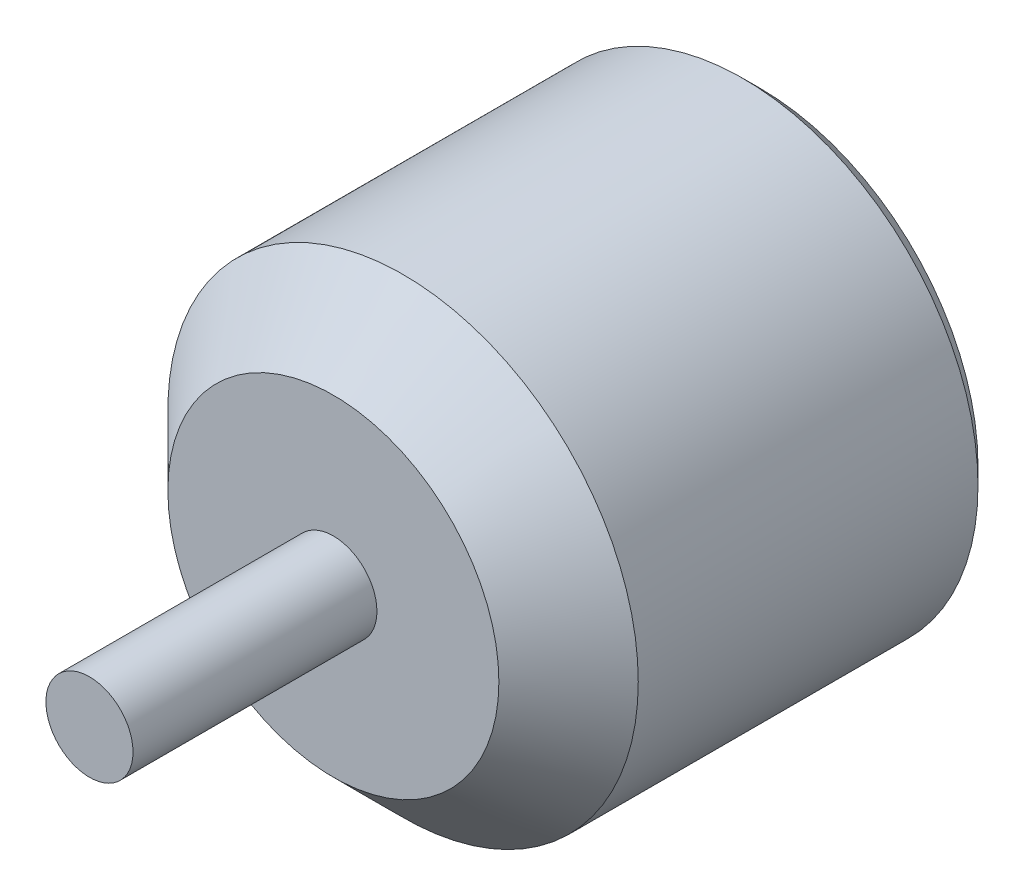
ISO-10303-21;
HEADER;
FILE_DESCRIPTION(('STEP AP214'),'2;1');
FILE_NAME('part.step','',(''),(''),'','','');
FILE_SCHEMA(('AUTOMOTIVE_DESIGN { 1 0 10303 214 1 1 1 1 }'));
ENDSEC;
DATA;
#1=APPLICATION_CONTEXT('core data for automotive mechanical design processes');
#2=APPLICATION_PROTOCOL_DEFINITION('international standard','automotive_design',2000,#1);
#3=PRODUCT_CONTEXT('',#1,'mechanical');
#4=PRODUCT('Part','Part','',(#3));
#5=PRODUCT_RELATED_PRODUCT_CATEGORY('part','',(#4));
#6=PRODUCT_DEFINITION_FORMATION('','',#4);
#7=PRODUCT_DEFINITION_CONTEXT('part definition',#1,'design');
#8=PRODUCT_DEFINITION('design','',#6,#7);
#9=PRODUCT_DEFINITION_SHAPE('','',#8);
#10=(LENGTH_UNIT() NAMED_UNIT(*) SI_UNIT(.MILLI.,.METRE.));
#11=(NAMED_UNIT(*) PLANE_ANGLE_UNIT() SI_UNIT($,.RADIAN.));
#12=(NAMED_UNIT(*) SI_UNIT($,.STERADIAN.) SOLID_ANGLE_UNIT());
#13=UNCERTAINTY_MEASURE_WITH_UNIT(LENGTH_MEASURE(1.E-05),#10,'distance_accuracy_value','');
#14=(GEOMETRIC_REPRESENTATION_CONTEXT(3) GLOBAL_UNCERTAINTY_ASSIGNED_CONTEXT((#13)) GLOBAL_UNIT_ASSIGNED_CONTEXT((#10,
#11,#12)) REPRESENTATION_CONTEXT('',''));
#15=CARTESIAN_POINT('',(0.,0.,0.));
#16=DIRECTION('',(0.,0.,1.));
#17=DIRECTION('',(1.,0.,0.));
#18=AXIS2_PLACEMENT_3D('',#15,#16,#17);
#19=CARTESIAN_POINT('',(0.,0.,24.5));
#20=DIRECTION('',(0.,0.,-1.));
#21=DIRECTION('',(-1.,0.,0.));
#22=AXIS2_PLACEMENT_3D('',#19,#20,#21);
#23=CYLINDRICAL_SURFACE('',#22,13.5);
#24=CARTESIAN_POINT('',(0.,0.,20.5));
#25=DIRECTION('',(0.,0.,1.));
#26=DIRECTION('',(1.,0.,0.));
#27=AXIS2_PLACEMENT_3D('',#24,#25,#26);
#28=CIRCLE('',#27,13.5);
#29=CARTESIAN_POINT('',(13.5,0.,20.5));
#30=VERTEX_POINT('',#29);
#31=EDGE_CURVE('E9',#30,#30,#28,.F.);
#32=ORIENTED_EDGE('',*,*,#31,.T.);
#33=EDGE_LOOP('',(#32));
#34=FACE_BOUND('',#33,.T.);
#35=CARTESIAN_POINT('',(0.,0.,1.));
#36=DIRECTION('',(0.,0.,1.));
#37=DIRECTION('',(1.,0.,0.));
#38=AXIS2_PLACEMENT_3D('',#35,#36,#37);
#39=CIRCLE('',#38,13.5);
#40=CARTESIAN_POINT('',(13.5,0.,1.));
#41=VERTEX_POINT('',#40);
#42=EDGE_CURVE('E37',#41,#41,#39,.T.);
#43=ORIENTED_EDGE('',*,*,#42,.T.);
#44=EDGE_LOOP('',(#43));
#45=FACE_BOUND('',#44,.T.);
#46=ADVANCED_FACE('F14',(#34,#45),#23,.T.);
#47=CARTESIAN_POINT('',(0.,0.,24.5));
#48=DIRECTION('',(0.,0.,1.));
#49=DIRECTION('',(1.,0.,0.));
#50=AXIS2_PLACEMENT_3D('',#47,#48,#49);
#51=PLANE('',#50);
#52=CARTESIAN_POINT('',(0.,0.,24.5));
#53=DIRECTION('',(0.,0.,1.));
#54=DIRECTION('',(1.,0.,0.));
#55=AXIS2_PLACEMENT_3D('',#52,#53,#54);
#56=CIRCLE('',#55,9.5);
#57=CARTESIAN_POINT('',(9.5,0.,24.5));
#58=VERTEX_POINT('',#57);
#59=EDGE_CURVE('E22',#58,#58,#56,.T.);
#60=ORIENTED_EDGE('',*,*,#59,.T.);
#61=EDGE_LOOP('',(#60));
#62=FACE_BOUND('',#61,.T.);
#63=CARTESIAN_POINT('',(0.,0.,24.5));
#64=DIRECTION('',(0.,0.,1.));
#65=DIRECTION('',(1.,0.,0.));
#66=AXIS2_PLACEMENT_3D('',#63,#64,#65);
#67=CIRCLE('',#66,2.5);
#68=CARTESIAN_POINT('',(2.5,0.,24.5));
#69=VERTEX_POINT('',#68);
#70=EDGE_CURVE('E43',#69,#69,#67,.T.);
#71=ORIENTED_EDGE('',*,*,#70,.F.);
#72=EDGE_LOOP('',(#71));
#73=FACE_BOUND('',#72,.T.);
#74=ADVANCED_FACE('F98',(#62,#73),#51,.T.);
#75=CARTESIAN_POINT('',(0.,0.,0.));
#76=DIRECTION('',(0.,0.,1.));
#77=DIRECTION('',(1.,0.,0.));
#78=AXIS2_PLACEMENT_3D('',#75,#76,#77);
#79=PLANE('',#78);
#80=CARTESIAN_POINT('',(0.,0.,0.));
#81=DIRECTION('',(0.,0.,1.));
#82=DIRECTION('',(1.,0.,0.));
#83=AXIS2_PLACEMENT_3D('',#80,#81,#82);
#84=CIRCLE('',#83,12.5);
#85=CARTESIAN_POINT('',(12.5,0.,0.));
#86=VERTEX_POINT('',#85);
#87=EDGE_CURVE('E30',#86,#86,#84,.F.);
#88=ORIENTED_EDGE('',*,*,#87,.T.);
#89=EDGE_LOOP('',(#88));
#90=FACE_BOUND('',#89,.T.);
#91=CARTESIAN_POINT('',(5.65685424949238,-5.65685424949238,0.));
#92=DIRECTION('',(0.,0.,-1.));
#93=DIRECTION('',(1.,0.,0.));
#94=AXIS2_PLACEMENT_3D('',#91,#92,#93);
#95=CIRCLE('',#94,1.5);
#96=CARTESIAN_POINT('',(7.15685424949238,-5.65685424949238,0.));
#97=VERTEX_POINT('',#96);
#98=EDGE_CURVE('E69',#97,#97,#95,.T.);
#99=ORIENTED_EDGE('',*,*,#98,.F.);
#100=EDGE_LOOP('',(#99));
#101=FACE_BOUND('',#100,.T.);
#102=CARTESIAN_POINT('',(-5.65685424949238,5.65685424949238,0.));
#103=DIRECTION('',(0.,0.,-1.));
#104=DIRECTION('',(1.,0.,0.));
#105=AXIS2_PLACEMENT_3D('',#102,#103,#104);
#106=CIRCLE('',#105,1.5);
#107=CARTESIAN_POINT('',(-4.15685424949238,5.65685424949238,0.));
#108=VERTEX_POINT('',#107);
#109=EDGE_CURVE('E60',#108,#108,#106,.T.);
#110=ORIENTED_EDGE('',*,*,#109,.F.);
#111=EDGE_LOOP('',(#110));
#112=FACE_BOUND('',#111,.T.);
#113=CARTESIAN_POINT('',(6.7175144212722,6.7175144212722,0.));
#114=DIRECTION('',(0.,0.,-1.));
#115=DIRECTION('',(1.,0.,0.));
#116=AXIS2_PLACEMENT_3D('',#113,#114,#115);
#117=CIRCLE('',#116,1.5);
#118=CARTESIAN_POINT('',(8.2175144212722,6.7175144212722,0.));
#119=VERTEX_POINT('',#118);
#120=EDGE_CURVE('E76',#119,#119,#117,.T.);
#121=ORIENTED_EDGE('',*,*,#120,.F.);
#122=EDGE_LOOP('',(#121));
#123=FACE_BOUND('',#122,.T.);
#124=CARTESIAN_POINT('',(-6.71751442127221,-6.7175144212722,0.));
#125=DIRECTION('',(0.,0.,-1.));
#126=DIRECTION('',(1.,0.,0.));
#127=AXIS2_PLACEMENT_3D('',#124,#125,#126);
#128=CIRCLE('',#127,1.5);
#129=CARTESIAN_POINT('',(-5.21751442127221,-6.7175144212722,0.));
#130=VERTEX_POINT('',#129);
#131=EDGE_CURVE('E52',#130,#130,#128,.T.);
#132=ORIENTED_EDGE('',*,*,#131,.F.);
#133=EDGE_LOOP('',(#132));
#134=FACE_BOUND('',#133,.T.);
#135=ADVANCED_FACE('F94',(#90,#101,#112,#123,#134),#79,.F.);
#136=CARTESIAN_POINT('',(0.,0.,38.5));
#137=DIRECTION('',(0.,0.,-1.));
#138=DIRECTION('',(-1.,0.,0.));
#139=AXIS2_PLACEMENT_3D('',#136,#137,#138);
#140=CYLINDRICAL_SURFACE('',#139,2.5);
#141=CARTESIAN_POINT('',(0.,0.,38.5));
#142=DIRECTION('',(0.,0.,1.));
#143=DIRECTION('',(1.,0.,0.));
#144=AXIS2_PLACEMENT_3D('',#141,#142,#143);
#145=CIRCLE('',#144,2.5);
#146=CARTESIAN_POINT('',(2.5,0.,38.5));
#147=VERTEX_POINT('',#146);
#148=EDGE_CURVE('E47',#147,#147,#145,.T.);
#149=ORIENTED_EDGE('',*,*,#148,.F.);
#150=EDGE_LOOP('',(#149));
#151=FACE_BOUND('',#150,.T.);
#152=ORIENTED_EDGE('',*,*,#70,.T.);
#153=EDGE_LOOP('',(#152));
#154=FACE_BOUND('',#153,.T.);
#155=ADVANCED_FACE('F97',(#151,#154),#140,.T.);
#156=CARTESIAN_POINT('',(0.,0.,38.5));
#157=DIRECTION('',(0.,0.,1.));
#158=DIRECTION('',(1.,0.,0.));
#159=AXIS2_PLACEMENT_3D('',#156,#157,#158);
#160=PLANE('',#159);
#161=ORIENTED_EDGE('',*,*,#148,.T.);
#162=EDGE_LOOP('',(#161));
#163=FACE_BOUND('',#162,.T.);
#164=ADVANCED_FACE('F105',(#163),#160,.T.);
#165=CARTESIAN_POINT('',(-6.71751442127221,-6.7175144212722,5.));
#166=DIRECTION('',(0.,0.,-1.));
#167=DIRECTION('',(-1.,0.,0.));
#168=AXIS2_PLACEMENT_3D('',#165,#166,#167);
#169=CYLINDRICAL_SURFACE('',#168,1.5);
#170=CARTESIAN_POINT('',(-6.71751442127221,-6.7175144212722,5.));
#171=DIRECTION('',(0.,0.,-1.));
#172=DIRECTION('',(1.,0.,0.));
#173=AXIS2_PLACEMENT_3D('',#170,#171,#172);
#174=CIRCLE('',#173,1.5);
#175=CARTESIAN_POINT('',(-5.21751442127221,-6.7175144212722,5.));
#176=VERTEX_POINT('',#175);
#177=EDGE_CURVE('E51',#176,#176,#174,.T.);
#178=ORIENTED_EDGE('',*,*,#177,.F.);
#179=EDGE_LOOP('',(#178));
#180=FACE_BOUND('',#179,.T.);
#181=ORIENTED_EDGE('',*,*,#131,.T.);
#182=EDGE_LOOP('',(#181));
#183=FACE_BOUND('',#182,.T.);
#184=ADVANCED_FACE('F103',(#180,#183),#169,.F.);
#185=CARTESIAN_POINT('',(0.,0.,5.));
#186=DIRECTION('',(0.,0.,-1.));
#187=DIRECTION('',(1.,0.,0.));
#188=AXIS2_PLACEMENT_3D('',#185,#186,#187);
#189=PLANE('',#188);
#190=ORIENTED_EDGE('',*,*,#177,.T.);
#191=EDGE_LOOP('',(#190));
#192=FACE_BOUND('',#191,.T.);
#193=ADVANCED_FACE('F90',(#192),#189,.T.);
#194=CARTESIAN_POINT('',(6.7175144212722,6.7175144212722,5.));
#195=DIRECTION('',(0.,0.,-1.));
#196=DIRECTION('',(-1.,0.,0.));
#197=AXIS2_PLACEMENT_3D('',#194,#195,#196);
#198=CYLINDRICAL_SURFACE('',#197,1.5);
#199=CARTESIAN_POINT('',(6.7175144212722,6.7175144212722,5.));
#200=DIRECTION('',(0.,0.,-1.));
#201=DIRECTION('',(1.,0.,0.));
#202=AXIS2_PLACEMENT_3D('',#199,#200,#201);
#203=CIRCLE('',#202,1.5);
#204=CARTESIAN_POINT('',(8.2175144212722,6.7175144212722,5.));
#205=VERTEX_POINT('',#204);
#206=EDGE_CURVE('E65',#205,#205,#203,.T.);
#207=ORIENTED_EDGE('',*,*,#206,.F.);
#208=EDGE_LOOP('',(#207));
#209=FACE_BOUND('',#208,.T.);
#210=ORIENTED_EDGE('',*,*,#120,.T.);
#211=EDGE_LOOP('',(#210));
#212=FACE_BOUND('',#211,.T.);
#213=ADVANCED_FACE('F87',(#209,#212),#198,.F.);
#214=CARTESIAN_POINT('',(0.,0.,5.));
#215=DIRECTION('',(0.,0.,-1.));
#216=DIRECTION('',(1.,0.,0.));
#217=AXIS2_PLACEMENT_3D('',#214,#215,#216);
#218=PLANE('',#217);
#219=ORIENTED_EDGE('',*,*,#206,.T.);
#220=EDGE_LOOP('',(#219));
#221=FACE_BOUND('',#220,.T.);
#222=ADVANCED_FACE('F85',(#221),#218,.T.);
#223=CARTESIAN_POINT('',(-5.65685424949238,5.65685424949238,5.));
#224=DIRECTION('',(0.,0.,-1.));
#225=DIRECTION('',(-1.,0.,0.));
#226=AXIS2_PLACEMENT_3D('',#223,#224,#225);
#227=CYLINDRICAL_SURFACE('',#226,1.5);
#228=CARTESIAN_POINT('',(-5.65685424949238,5.65685424949238,5.));
#229=DIRECTION('',(0.,0.,-1.));
#230=DIRECTION('',(1.,0.,0.));
#231=AXIS2_PLACEMENT_3D('',#228,#229,#230);
#232=CIRCLE('',#231,1.5);
#233=CARTESIAN_POINT('',(-4.15685424949238,5.65685424949238,5.));
#234=VERTEX_POINT('',#233);
#235=EDGE_CURVE('E64',#234,#234,#232,.T.);
#236=ORIENTED_EDGE('',*,*,#235,.F.);
#237=EDGE_LOOP('',(#236));
#238=FACE_BOUND('',#237,.T.);
#239=ORIENTED_EDGE('',*,*,#109,.T.);
#240=EDGE_LOOP('',(#239));
#241=FACE_BOUND('',#240,.T.);
#242=ADVANCED_FACE('F145',(#238,#241),#227,.F.);
#243=CARTESIAN_POINT('',(0.,0.,5.));
#244=DIRECTION('',(0.,0.,-1.));
#245=DIRECTION('',(1.,0.,0.));
#246=AXIS2_PLACEMENT_3D('',#243,#244,#245);
#247=PLANE('',#246);
#248=ORIENTED_EDGE('',*,*,#235,.T.);
#249=EDGE_LOOP('',(#248));
#250=FACE_BOUND('',#249,.T.);
#251=ADVANCED_FACE('F147',(#250),#247,.T.);
#252=CARTESIAN_POINT('',(5.65685424949238,-5.65685424949238,5.));
#253=DIRECTION('',(0.,0.,-1.));
#254=DIRECTION('',(-1.,0.,0.));
#255=AXIS2_PLACEMENT_3D('',#252,#253,#254);
#256=CYLINDRICAL_SURFACE('',#255,1.5);
#257=CARTESIAN_POINT('',(5.65685424949238,-5.65685424949238,5.));
#258=DIRECTION('',(0.,0.,-1.));
#259=DIRECTION('',(1.,0.,0.));
#260=AXIS2_PLACEMENT_3D('',#257,#258,#259);
#261=CIRCLE('',#260,1.5);
#262=CARTESIAN_POINT('',(7.15685424949238,-5.65685424949238,5.));
#263=VERTEX_POINT('',#262);
#264=EDGE_CURVE('E56',#263,#263,#261,.T.);
#265=ORIENTED_EDGE('',*,*,#264,.F.);
#266=EDGE_LOOP('',(#265));
#267=FACE_BOUND('',#266,.T.);
#268=ORIENTED_EDGE('',*,*,#98,.T.);
#269=EDGE_LOOP('',(#268));
#270=FACE_BOUND('',#269,.T.);
#271=ADVANCED_FACE('F134',(#267,#270),#256,.F.);
#272=CARTESIAN_POINT('',(0.,0.,5.));
#273=DIRECTION('',(0.,0.,-1.));
#274=DIRECTION('',(1.,0.,0.));
#275=AXIS2_PLACEMENT_3D('',#272,#273,#274);
#276=PLANE('',#275);
#277=ORIENTED_EDGE('',*,*,#264,.T.);
#278=EDGE_LOOP('',(#277));
#279=FACE_BOUND('',#278,.T.);
#280=ADVANCED_FACE('F127',(#279),#276,.T.);
#281=CARTESIAN_POINT('',(0.,0.,1.));
#282=DIRECTION('',(0.,0.,1.));
#283=DIRECTION('',(1.,0.,0.));
#284=AXIS2_PLACEMENT_3D('',#281,#282,#283);
#285=CONICAL_SURFACE('',#284,13.5,0.785398163397448);
#286=ORIENTED_EDGE('',*,*,#87,.F.);
#287=EDGE_LOOP('',(#286));
#288=FACE_BOUND('',#287,.T.);
#289=ORIENTED_EDGE('',*,*,#42,.F.);
#290=EDGE_LOOP('',(#289));
#291=FACE_BOUND('',#290,.T.);
#292=ADVANCED_FACE('F125',(#288,#291),#285,.T.);
#293=CARTESIAN_POINT('',(0.,0.,24.5));
#294=DIRECTION('',(0.,0.,-1.));
#295=DIRECTION('',(-1.,0.,0.));
#296=AXIS2_PLACEMENT_3D('',#293,#294,#295);
#297=CONICAL_SURFACE('',#296,9.5,0.785398163397448);
#298=ORIENTED_EDGE('',*,*,#31,.F.);
#299=EDGE_LOOP('',(#298));
#300=FACE_BOUND('',#299,.T.);
#301=ORIENTED_EDGE('',*,*,#59,.F.);
#302=EDGE_LOOP('',(#301));
#303=FACE_BOUND('',#302,.T.);
#304=ADVANCED_FACE('F16',(#300,#303),#297,.T.);
#305=CLOSED_SHELL('',(#46,#74,#135,#155,#164,#184,#193,#213,#222,#242,#251,#271,#280,#292,#304));
#306=MANIFOLD_SOLID_BREP('B1',#305);
#307=ADVANCED_BREP_SHAPE_REPRESENTATION('',(#18,#306),#14);
#308=SHAPE_DEFINITION_REPRESENTATION(#9,#307);
ENDSEC;
END-ISO-10303-21;
